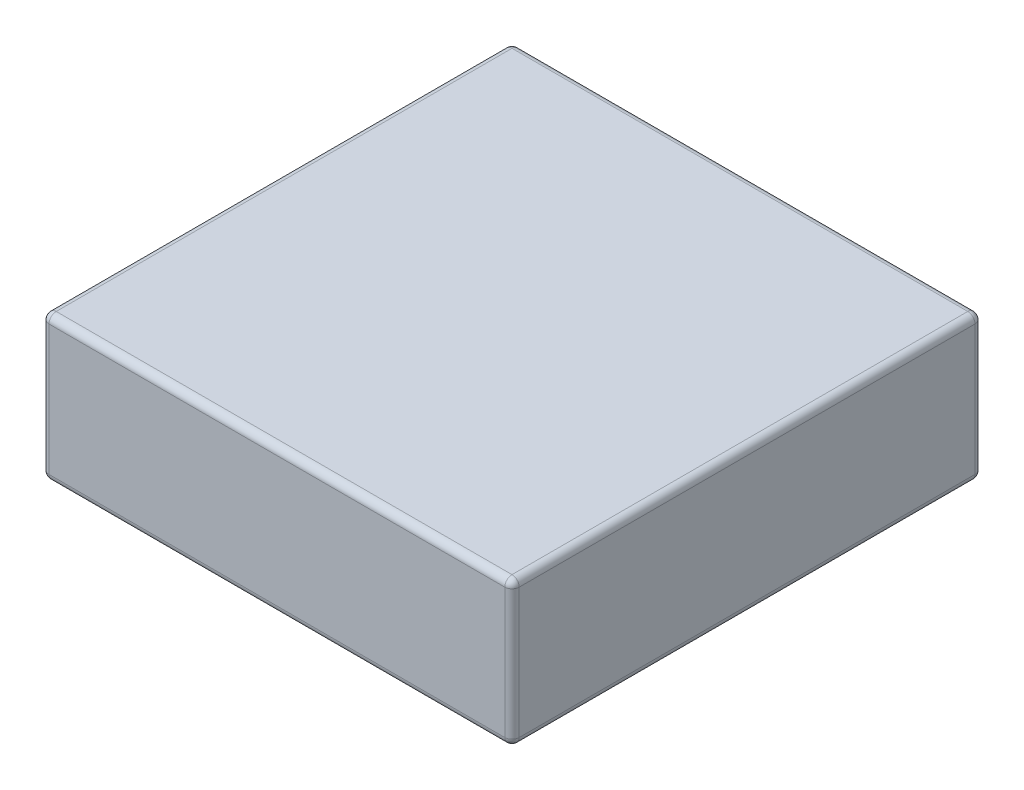
ISO-10303-21;
HEADER;
FILE_DESCRIPTION(('STEP AP214'),'2;1');
FILE_NAME('part.step','',(''),(''),'','','');
FILE_SCHEMA(('AUTOMOTIVE_DESIGN { 1 0 10303 214 1 1 1 1 }'));
ENDSEC;
DATA;
#1=APPLICATION_CONTEXT('core data for automotive mechanical design processes');
#2=APPLICATION_PROTOCOL_DEFINITION('international standard','automotive_design',2000,#1);
#3=PRODUCT_CONTEXT('',#1,'mechanical');
#4=PRODUCT('Part','Part','',(#3));
#5=PRODUCT_RELATED_PRODUCT_CATEGORY('part','',(#4));
#6=PRODUCT_DEFINITION_FORMATION('','',#4);
#7=PRODUCT_DEFINITION_CONTEXT('part definition',#1,'design');
#8=PRODUCT_DEFINITION('design','',#6,#7);
#9=PRODUCT_DEFINITION_SHAPE('','',#8);
#10=(LENGTH_UNIT() NAMED_UNIT(*) SI_UNIT(.MILLI.,.METRE.));
#11=(NAMED_UNIT(*) PLANE_ANGLE_UNIT() SI_UNIT($,.RADIAN.));
#12=(NAMED_UNIT(*) SI_UNIT($,.STERADIAN.) SOLID_ANGLE_UNIT());
#13=UNCERTAINTY_MEASURE_WITH_UNIT(LENGTH_MEASURE(1.E-05),#10,'distance_accuracy_value','');
#14=(GEOMETRIC_REPRESENTATION_CONTEXT(3) GLOBAL_UNCERTAINTY_ASSIGNED_CONTEXT((#13)) GLOBAL_UNIT_ASSIGNED_CONTEXT((#10,
#11,#12)) REPRESENTATION_CONTEXT('',''));
#15=CARTESIAN_POINT('',(0.,0.,0.));
#16=DIRECTION('',(0.,0.,1.));
#17=DIRECTION('',(1.,0.,0.));
#18=AXIS2_PLACEMENT_3D('',#15,#16,#17);
#19=CARTESIAN_POINT('',(0.,20.,0.));
#20=DIRECTION('',(1.,0.,0.));
#21=DIRECTION('',(0.,0.,-1.));
#22=AXIS2_PLACEMENT_3D('',#19,#20,#21);
#23=PLANE('',#22);
#24=DIRECTION('',(0.,-1.,0.));
#25=VECTOR('',#24,1.);
#26=CARTESIAN_POINT('',(0.,20.,-1.));
#27=LINE('',#26,#25);
#28=CARTESIAN_POINT('',(0.,1.,-1.));
#29=VERTEX_POINT('',#28);
#30=CARTESIAN_POINT('',(0.,19.,-1.));
#31=VERTEX_POINT('',#30);
#32=EDGE_CURVE('E138',#29,#31,#27,.F.);
#33=ORIENTED_EDGE('',*,*,#32,.T.);
#34=DIRECTION('',(0.,0.,1.));
#35=VECTOR('',#34,1.);
#36=CARTESIAN_POINT('',(0.,19.,0.));
#37=LINE('',#36,#35);
#38=CARTESIAN_POINT('',(0.,19.,-64.));
#39=VERTEX_POINT('',#38);
#40=EDGE_CURVE('E184',#31,#39,#37,.F.);
#41=ORIENTED_EDGE('',*,*,#40,.T.);
#42=DIRECTION('',(0.,-1.,0.));
#43=VECTOR('',#42,1.);
#44=CARTESIAN_POINT('',(0.,20.,-64.));
#45=LINE('',#44,#43);
#46=CARTESIAN_POINT('',(0.,1.,-64.));
#47=VERTEX_POINT('',#46);
#48=EDGE_CURVE('E179',#39,#47,#45,.T.);
#49=ORIENTED_EDGE('',*,*,#48,.T.);
#50=DIRECTION('',(0.,0.,1.));
#51=VECTOR('',#50,1.);
#52=CARTESIAN_POINT('',(0.,1.,0.));
#53=LINE('',#52,#51);
#54=EDGE_CURVE('E173',#47,#29,#53,.T.);
#55=ORIENTED_EDGE('',*,*,#54,.T.);
#56=EDGE_LOOP('',(#33,#41,#49,#55));
#57=FACE_BOUND('',#56,.T.);
#58=ADVANCED_FACE('F41',(#57),#23,.F.);
#59=CARTESIAN_POINT('',(0.,20.,0.));
#60=DIRECTION('',(0.,0.,-1.));
#61=DIRECTION('',(-1.,0.,0.));
#62=AXIS2_PLACEMENT_3D('',#59,#60,#61);
#63=PLANE('',#62);
#64=DIRECTION('',(0.,-1.,0.));
#65=VECTOR('',#64,1.);
#66=CARTESIAN_POINT('',(64.,20.,0.));
#67=LINE('',#66,#65);
#68=CARTESIAN_POINT('',(64.,1.,0.));
#69=VERTEX_POINT('',#68);
#70=CARTESIAN_POINT('',(64.,19.,0.));
#71=VERTEX_POINT('',#70);
#72=EDGE_CURVE('E163',#69,#71,#67,.F.);
#73=ORIENTED_EDGE('',*,*,#72,.T.);
#74=DIRECTION('',(1.,0.,0.));
#75=VECTOR('',#74,1.);
#76=CARTESIAN_POINT('',(0.,19.,0.));
#77=LINE('',#76,#75);
#78=CARTESIAN_POINT('',(1.,19.,0.));
#79=VERTEX_POINT('',#78);
#80=EDGE_CURVE('E167',#71,#79,#77,.F.);
#81=ORIENTED_EDGE('',*,*,#80,.T.);
#82=DIRECTION('',(0.,-1.,0.));
#83=VECTOR('',#82,1.);
#84=CARTESIAN_POINT('',(1.,20.,0.));
#85=LINE('',#84,#83);
#86=CARTESIAN_POINT('',(1.,1.,0.));
#87=VERTEX_POINT('',#86);
#88=EDGE_CURVE('E136',#79,#87,#85,.T.);
#89=ORIENTED_EDGE('',*,*,#88,.T.);
#90=DIRECTION('',(1.,0.,0.));
#91=VECTOR('',#90,1.);
#92=CARTESIAN_POINT('',(65.,1.,0.));
#93=LINE('',#92,#91);
#94=EDGE_CURVE('E156',#87,#69,#93,.T.);
#95=ORIENTED_EDGE('',*,*,#94,.T.);
#96=EDGE_LOOP('',(#73,#81,#89,#95));
#97=FACE_BOUND('',#96,.T.);
#98=ADVANCED_FACE('F165',(#97),#63,.F.);
#99=CARTESIAN_POINT('',(65.,20.,0.));
#100=DIRECTION('',(-1.,0.,0.));
#101=DIRECTION('',(0.,0.,1.));
#102=AXIS2_PLACEMENT_3D('',#99,#100,#101);
#103=PLANE('',#102);
#104=DIRECTION('',(0.,-1.,0.));
#105=VECTOR('',#104,1.);
#106=CARTESIAN_POINT('',(65.,20.,-64.));
#107=LINE('',#106,#105);
#108=CARTESIAN_POINT('',(65.,1.,-64.));
#109=VERTEX_POINT('',#108);
#110=CARTESIAN_POINT('',(65.,19.,-64.));
#111=VERTEX_POINT('',#110);
#112=EDGE_CURVE('E190',#109,#111,#107,.F.);
#113=ORIENTED_EDGE('',*,*,#112,.T.);
#114=DIRECTION('',(0.,0.,-1.));
#115=VECTOR('',#114,1.);
#116=CARTESIAN_POINT('',(65.,19.,0.));
#117=LINE('',#116,#115);
#118=CARTESIAN_POINT('',(65.,19.,-1.));
#119=VERTEX_POINT('',#118);
#120=EDGE_CURVE('E197',#111,#119,#117,.F.);
#121=ORIENTED_EDGE('',*,*,#120,.T.);
#122=DIRECTION('',(0.,-1.,0.));
#123=VECTOR('',#122,1.);
#124=CARTESIAN_POINT('',(65.,20.,-1.));
#125=LINE('',#124,#123);
#126=CARTESIAN_POINT('',(65.,1.,-1.));
#127=VERTEX_POINT('',#126);
#128=EDGE_CURVE('E193',#119,#127,#125,.T.);
#129=ORIENTED_EDGE('',*,*,#128,.T.);
#130=DIRECTION('',(0.,0.,-1.));
#131=VECTOR('',#130,1.);
#132=CARTESIAN_POINT('',(65.,1.,-65.));
#133=LINE('',#132,#131);
#134=EDGE_CURVE('E187',#127,#109,#133,.T.);
#135=ORIENTED_EDGE('',*,*,#134,.T.);
#136=EDGE_LOOP('',(#113,#121,#129,#135));
#137=FACE_BOUND('',#136,.T.);
#138=ADVANCED_FACE('F336',(#137),#103,.F.);
#139=CARTESIAN_POINT('',(0.,20.,-65.));
#140=DIRECTION('',(0.,0.,1.));
#141=DIRECTION('',(1.,0.,0.));
#142=AXIS2_PLACEMENT_3D('',#139,#140,#141);
#143=PLANE('',#142);
#144=DIRECTION('',(0.,-1.,0.));
#145=VECTOR('',#144,1.);
#146=CARTESIAN_POINT('',(1.,20.,-65.));
#147=LINE('',#146,#145);
#148=CARTESIAN_POINT('',(1.,1.,-65.));
#149=VERTEX_POINT('',#148);
#150=CARTESIAN_POINT('',(1.,19.,-65.));
#151=VERTEX_POINT('',#150);
#152=EDGE_CURVE('E203',#149,#151,#147,.F.);
#153=ORIENTED_EDGE('',*,*,#152,.T.);
#154=DIRECTION('',(-1.,0.,0.));
#155=VECTOR('',#154,1.);
#156=CARTESIAN_POINT('',(0.,19.,-65.));
#157=LINE('',#156,#155);
#158=CARTESIAN_POINT('',(64.,19.,-65.));
#159=VERTEX_POINT('',#158);
#160=EDGE_CURVE('E210',#151,#159,#157,.F.);
#161=ORIENTED_EDGE('',*,*,#160,.T.);
#162=DIRECTION('',(0.,-1.,0.));
#163=VECTOR('',#162,1.);
#164=CARTESIAN_POINT('',(64.,20.,-65.));
#165=LINE('',#164,#163);
#166=CARTESIAN_POINT('',(64.,1.,-65.));
#167=VERTEX_POINT('',#166);
#168=EDGE_CURVE('E206',#159,#167,#165,.T.);
#169=ORIENTED_EDGE('',*,*,#168,.T.);
#170=DIRECTION('',(-1.,0.,0.));
#171=VECTOR('',#170,1.);
#172=CARTESIAN_POINT('',(0.,1.,-65.));
#173=LINE('',#172,#171);
#174=EDGE_CURVE('E200',#167,#149,#173,.T.);
#175=ORIENTED_EDGE('',*,*,#174,.T.);
#176=EDGE_LOOP('',(#153,#161,#169,#175));
#177=FACE_BOUND('',#176,.T.);
#178=ADVANCED_FACE('F347',(#177),#143,.F.);
#179=CARTESIAN_POINT('',(0.,20.,0.));
#180=DIRECTION('',(0.,-1.,0.));
#181=DIRECTION('',(0.,0.,-1.));
#182=AXIS2_PLACEMENT_3D('',#179,#180,#181);
#183=PLANE('',#182);
#184=DIRECTION('',(0.,0.,-1.));
#185=VECTOR('',#184,1.);
#186=CARTESIAN_POINT('',(64.,20.,0.));
#187=LINE('',#186,#185);
#188=CARTESIAN_POINT('',(64.,20.,-1.));
#189=VERTEX_POINT('',#188);
#190=CARTESIAN_POINT('',(64.,20.,-64.));
#191=VERTEX_POINT('',#190);
#192=EDGE_CURVE('E219',#189,#191,#187,.T.);
#193=ORIENTED_EDGE('',*,*,#192,.T.);
#194=DIRECTION('',(-1.,0.,0.));
#195=VECTOR('',#194,1.);
#196=CARTESIAN_POINT('',(0.,20.,-64.));
#197=LINE('',#196,#195);
#198=CARTESIAN_POINT('',(1.,20.,-64.));
#199=VERTEX_POINT('',#198);
#200=EDGE_CURVE('E222',#191,#199,#197,.T.);
#201=ORIENTED_EDGE('',*,*,#200,.T.);
#202=DIRECTION('',(0.,0.,1.));
#203=VECTOR('',#202,1.);
#204=CARTESIAN_POINT('',(1.,20.,0.));
#205=LINE('',#204,#203);
#206=CARTESIAN_POINT('',(1.,20.,-1.));
#207=VERTEX_POINT('',#206);
#208=EDGE_CURVE('E213',#199,#207,#205,.T.);
#209=ORIENTED_EDGE('',*,*,#208,.T.);
#210=DIRECTION('',(1.,0.,0.));
#211=VECTOR('',#210,1.);
#212=CARTESIAN_POINT('',(0.,20.,-1.));
#213=LINE('',#212,#211);
#214=EDGE_CURVE('E216',#207,#189,#213,.T.);
#215=ORIENTED_EDGE('',*,*,#214,.T.);
#216=EDGE_LOOP('',(#193,#201,#209,#215));
#217=FACE_BOUND('',#216,.T.);
#218=ADVANCED_FACE('F328',(#217),#183,.F.);
#219=CARTESIAN_POINT('',(0.,0.,0.));
#220=DIRECTION('',(0.,-1.,0.));
#221=DIRECTION('',(0.,0.,-1.));
#222=AXIS2_PLACEMENT_3D('',#219,#220,#221);
#223=PLANE('',#222);
#224=DIRECTION('',(0.,0.,-1.));
#225=VECTOR('',#224,1.);
#226=CARTESIAN_POINT('',(64.,0.,0.));
#227=LINE('',#226,#225);
#228=CARTESIAN_POINT('',(64.,0.,-64.));
#229=VERTEX_POINT('',#228);
#230=CARTESIAN_POINT('',(64.,0.,-1.));
#231=VERTEX_POINT('',#230);
#232=EDGE_CURVE('E51',#229,#231,#227,.F.);
#233=ORIENTED_EDGE('',*,*,#232,.T.);
#234=DIRECTION('',(1.,0.,0.));
#235=VECTOR('',#234,1.);
#236=CARTESIAN_POINT('',(0.,0.,-1.));
#237=LINE('',#236,#235);
#238=CARTESIAN_POINT('',(1.,0.,-1.));
#239=VERTEX_POINT('',#238);
#240=EDGE_CURVE('E12',#231,#239,#237,.F.);
#241=ORIENTED_EDGE('',*,*,#240,.T.);
#242=DIRECTION('',(0.,0.,1.));
#243=VECTOR('',#242,1.);
#244=CARTESIAN_POINT('',(1.,0.,-65.));
#245=LINE('',#244,#243);
#246=CARTESIAN_POINT('',(1.,0.,-64.));
#247=VERTEX_POINT('',#246);
#248=EDGE_CURVE('E226',#239,#247,#245,.F.);
#249=ORIENTED_EDGE('',*,*,#248,.T.);
#250=DIRECTION('',(-1.,0.,0.));
#251=VECTOR('',#250,1.);
#252=CARTESIAN_POINT('',(65.,0.,-64.));
#253=LINE('',#252,#251);
#254=EDGE_CURVE('E62',#247,#229,#253,.F.);
#255=ORIENTED_EDGE('',*,*,#254,.T.);
#256=EDGE_LOOP('',(#233,#241,#249,#255));
#257=FACE_BOUND('',#256,.T.);
#258=ADVANCED_FACE('F449',(#257),#223,.T.);
#259=CARTESIAN_POINT('',(64.,20.,-64.));
#260=DIRECTION('',(0.,-1.,0.));
#261=DIRECTION('',(0.,0.,-1.));
#262=AXIS2_PLACEMENT_3D('',#259,#260,#261);
#263=CYLINDRICAL_SURFACE('',#262,1.);
#264=CARTESIAN_POINT('',(64.,19.,-64.));
#265=DIRECTION('',(0.,1.,0.));
#266=DIRECTION('',(0.,0.,1.));
#267=AXIS2_PLACEMENT_3D('',#264,#265,#266);
#268=CIRCLE('',#267,1.);
#269=EDGE_CURVE('E45',#111,#159,#268,.T.);
#270=ORIENTED_EDGE('',*,*,#269,.F.);
#271=ORIENTED_EDGE('',*,*,#112,.F.);
#272=CARTESIAN_POINT('',(64.,1.,-64.));
#273=DIRECTION('',(0.,-1.,0.));
#274=DIRECTION('',(0.,0.,-1.));
#275=AXIS2_PLACEMENT_3D('',#272,#273,#274);
#276=CIRCLE('',#275,1.);
#277=EDGE_CURVE('E303',#167,#109,#276,.T.);
#278=ORIENTED_EDGE('',*,*,#277,.F.);
#279=ORIENTED_EDGE('',*,*,#168,.F.);
#280=EDGE_LOOP('',(#270,#271,#278,#279));
#281=FACE_BOUND('',#280,.T.);
#282=ADVANCED_FACE('F43',(#281),#263,.T.);
#283=CARTESIAN_POINT('',(64.,19.,-64.));
#284=DIRECTION('',(0.,0.,-1.));
#285=DIRECTION('',(-1.,0.,0.));
#286=AXIS2_PLACEMENT_3D('',#283,#284,#285);
#287=SPHERICAL_SURFACE('',#286,1.);
#288=CARTESIAN_POINT('',(64.,19.,-64.));
#289=DIRECTION('',(0.,0.,-1.));
#290=DIRECTION('',(-1.,0.,0.));
#291=AXIS2_PLACEMENT_3D('',#288,#289,#290);
#292=CIRCLE('',#291,1.);
#293=EDGE_CURVE('E296',#111,#191,#292,.F.);
#294=ORIENTED_EDGE('',*,*,#293,.F.);
#295=ORIENTED_EDGE('',*,*,#269,.T.);
#296=CARTESIAN_POINT('',(64.,19.,-64.));
#297=DIRECTION('',(1.,0.,0.));
#298=DIRECTION('',(0.,0.,-1.));
#299=AXIS2_PLACEMENT_3D('',#296,#297,#298);
#300=CIRCLE('',#299,1.);
#301=EDGE_CURVE('E300',#191,#159,#300,.F.);
#302=ORIENTED_EDGE('',*,*,#301,.F.);
#303=EDGE_LOOP('',(#294,#295,#302));
#304=FACE_BOUND('',#303,.T.);
#305=ADVANCED_FACE('F316',(#304),#287,.T.);
#306=CARTESIAN_POINT('',(64.,1.,-64.));
#307=DIRECTION('',(1.,0.,0.));
#308=DIRECTION('',(0.,1.,0.));
#309=AXIS2_PLACEMENT_3D('',#306,#307,#308);
#310=SPHERICAL_SURFACE('',#309,1.);
#311=CARTESIAN_POINT('',(64.,1.,-64.));
#312=DIRECTION('',(1.,0.,0.));
#313=DIRECTION('',(0.,0.,-1.));
#314=AXIS2_PLACEMENT_3D('',#311,#312,#313);
#315=CIRCLE('',#314,1.);
#316=EDGE_CURVE('E289',#167,#229,#315,.F.);
#317=ORIENTED_EDGE('',*,*,#316,.F.);
#318=ORIENTED_EDGE('',*,*,#277,.T.);
#319=CARTESIAN_POINT('',(64.,1.,-64.));
#320=DIRECTION('',(0.,0.,-1.));
#321=DIRECTION('',(-1.,0.,0.));
#322=AXIS2_PLACEMENT_3D('',#319,#320,#321);
#323=CIRCLE('',#322,1.);
#324=EDGE_CURVE('E292',#229,#109,#323,.F.);
#325=ORIENTED_EDGE('',*,*,#324,.F.);
#326=EDGE_LOOP('',(#317,#318,#325));
#327=FACE_BOUND('',#326,.T.);
#328=ADVANCED_FACE('F474',(#327),#310,.T.);
#329=CARTESIAN_POINT('',(0.,19.,-64.));
#330=DIRECTION('',(-1.,0.,0.));
#331=DIRECTION('',(0.,0.,1.));
#332=AXIS2_PLACEMENT_3D('',#329,#330,#331);
#333=CYLINDRICAL_SURFACE('',#332,1.);
#334=ORIENTED_EDGE('',*,*,#301,.T.);
#335=ORIENTED_EDGE('',*,*,#160,.F.);
#336=CARTESIAN_POINT('',(1.,19.,-64.));
#337=DIRECTION('',(-1.,0.,0.));
#338=DIRECTION('',(0.,0.,1.));
#339=AXIS2_PLACEMENT_3D('',#336,#337,#338);
#340=CIRCLE('',#339,1.);
#341=EDGE_CURVE('E281',#199,#151,#340,.T.);
#342=ORIENTED_EDGE('',*,*,#341,.F.);
#343=ORIENTED_EDGE('',*,*,#200,.F.);
#344=EDGE_LOOP('',(#334,#335,#342,#343));
#345=FACE_BOUND('',#344,.T.);
#346=ADVANCED_FACE('F324',(#345),#333,.T.);
#347=CARTESIAN_POINT('',(64.,19.,0.));
#348=DIRECTION('',(0.,0.,-1.));
#349=DIRECTION('',(-1.,0.,0.));
#350=AXIS2_PLACEMENT_3D('',#347,#348,#349);
#351=CYLINDRICAL_SURFACE('',#350,1.);
#352=ORIENTED_EDGE('',*,*,#293,.T.);
#353=ORIENTED_EDGE('',*,*,#192,.F.);
#354=CARTESIAN_POINT('',(64.,19.,-1.));
#355=DIRECTION('',(0.,0.,1.));
#356=DIRECTION('',(1.,0.,0.));
#357=AXIS2_PLACEMENT_3D('',#354,#355,#356);
#358=CIRCLE('',#357,1.);
#359=EDGE_CURVE('E277',#119,#189,#358,.T.);
#360=ORIENTED_EDGE('',*,*,#359,.F.);
#361=ORIENTED_EDGE('',*,*,#120,.F.);
#362=EDGE_LOOP('',(#352,#353,#360,#361));
#363=FACE_BOUND('',#362,.T.);
#364=ADVANCED_FACE('F333',(#363),#351,.T.);
#365=CARTESIAN_POINT('',(64.,20.,-1.));
#366=DIRECTION('',(0.,-1.,0.));
#367=DIRECTION('',(0.,0.,-1.));
#368=AXIS2_PLACEMENT_3D('',#365,#366,#367);
#369=CYLINDRICAL_SURFACE('',#368,1.);
#370=CARTESIAN_POINT('',(64.,1.,-1.));
#371=DIRECTION('',(0.,-1.,0.));
#372=DIRECTION('',(0.,0.,-1.));
#373=AXIS2_PLACEMENT_3D('',#370,#371,#372);
#374=CIRCLE('',#373,1.);
#375=EDGE_CURVE('E269',#127,#69,#374,.T.);
#376=ORIENTED_EDGE('',*,*,#375,.F.);
#377=ORIENTED_EDGE('',*,*,#128,.F.);
#378=CARTESIAN_POINT('',(64.,19.,-1.));
#379=DIRECTION('',(0.,1.,0.));
#380=DIRECTION('',(0.,0.,1.));
#381=AXIS2_PLACEMENT_3D('',#378,#379,#380);
#382=CIRCLE('',#381,1.);
#383=EDGE_CURVE('E273',#71,#119,#382,.T.);
#384=ORIENTED_EDGE('',*,*,#383,.F.);
#385=ORIENTED_EDGE('',*,*,#72,.F.);
#386=EDGE_LOOP('',(#376,#377,#384,#385));
#387=FACE_BOUND('',#386,.T.);
#388=ADVANCED_FACE('F340',(#387),#369,.T.);
#389=CARTESIAN_POINT('',(64.,1.,0.));
#390=DIRECTION('',(0.,0.,1.));
#391=DIRECTION('',(1.,0.,0.));
#392=AXIS2_PLACEMENT_3D('',#389,#390,#391);
#393=CYLINDRICAL_SURFACE('',#392,1.);
#394=ORIENTED_EDGE('',*,*,#324,.T.);
#395=ORIENTED_EDGE('',*,*,#134,.F.);
#396=CARTESIAN_POINT('',(64.,1.,-1.));
#397=DIRECTION('',(0.,0.,1.));
#398=DIRECTION('',(1.,0.,0.));
#399=AXIS2_PLACEMENT_3D('',#396,#397,#398);
#400=CIRCLE('',#399,1.);
#401=EDGE_CURVE('E266',#231,#127,#400,.T.);
#402=ORIENTED_EDGE('',*,*,#401,.F.);
#403=ORIENTED_EDGE('',*,*,#232,.F.);
#404=EDGE_LOOP('',(#394,#395,#402,#403));
#405=FACE_BOUND('',#404,.T.);
#406=ADVANCED_FACE('F345',(#405),#393,.T.);
#407=CARTESIAN_POINT('',(0.,1.,-64.));
#408=DIRECTION('',(1.,0.,0.));
#409=DIRECTION('',(0.,0.,-1.));
#410=AXIS2_PLACEMENT_3D('',#407,#408,#409);
#411=CYLINDRICAL_SURFACE('',#410,1.);
#412=ORIENTED_EDGE('',*,*,#316,.T.);
#413=ORIENTED_EDGE('',*,*,#254,.F.);
#414=CARTESIAN_POINT('',(1.,1.,-64.));
#415=DIRECTION('',(-1.,0.,0.));
#416=DIRECTION('',(0.,0.,1.));
#417=AXIS2_PLACEMENT_3D('',#414,#415,#416);
#418=CIRCLE('',#417,1.);
#419=EDGE_CURVE('E262',#149,#247,#418,.T.);
#420=ORIENTED_EDGE('',*,*,#419,.F.);
#421=ORIENTED_EDGE('',*,*,#174,.F.);
#422=EDGE_LOOP('',(#412,#413,#420,#421));
#423=FACE_BOUND('',#422,.T.);
#424=ADVANCED_FACE('F356',(#423),#411,.T.);
#425=CARTESIAN_POINT('',(1.,20.,-64.));
#426=DIRECTION('',(0.,-1.,0.));
#427=DIRECTION('',(0.,0.,-1.));
#428=AXIS2_PLACEMENT_3D('',#425,#426,#427);
#429=CYLINDRICAL_SURFACE('',#428,1.);
#430=CARTESIAN_POINT('',(1.,19.,-64.));
#431=DIRECTION('',(0.,1.,0.));
#432=DIRECTION('',(0.,0.,1.));
#433=AXIS2_PLACEMENT_3D('',#430,#431,#432);
#434=CIRCLE('',#433,1.);
#435=EDGE_CURVE('E285',#151,#39,#434,.T.);
#436=ORIENTED_EDGE('',*,*,#435,.F.);
#437=ORIENTED_EDGE('',*,*,#152,.F.);
#438=CARTESIAN_POINT('',(1.,1.,-64.));
#439=DIRECTION('',(0.,-1.,0.));
#440=DIRECTION('',(0.,0.,-1.));
#441=AXIS2_PLACEMENT_3D('',#438,#439,#440);
#442=CIRCLE('',#441,1.);
#443=EDGE_CURVE('E258',#47,#149,#442,.T.);
#444=ORIENTED_EDGE('',*,*,#443,.F.);
#445=ORIENTED_EDGE('',*,*,#48,.F.);
#446=EDGE_LOOP('',(#436,#437,#444,#445));
#447=FACE_BOUND('',#446,.T.);
#448=ADVANCED_FACE('F352',(#447),#429,.T.);
#449=CARTESIAN_POINT('',(1.,19.,-64.));
#450=DIRECTION('',(0.,0.,-1.));
#451=DIRECTION('',(-1.,0.,0.));
#452=AXIS2_PLACEMENT_3D('',#449,#450,#451);
#453=SPHERICAL_SURFACE('',#452,1.);
#454=ORIENTED_EDGE('',*,*,#341,.T.);
#455=ORIENTED_EDGE('',*,*,#435,.T.);
#456=CARTESIAN_POINT('',(1.,19.,-64.));
#457=DIRECTION('',(0.,0.,-1.));
#458=DIRECTION('',(-1.,0.,0.));
#459=AXIS2_PLACEMENT_3D('',#456,#457,#458);
#460=CIRCLE('',#459,1.);
#461=EDGE_CURVE('E254',#199,#39,#460,.F.);
#462=ORIENTED_EDGE('',*,*,#461,.F.);
#463=EDGE_LOOP('',(#454,#455,#462));
#464=FACE_BOUND('',#463,.T.);
#465=ADVANCED_FACE('F366',(#464),#453,.T.);
#466=CARTESIAN_POINT('',(64.,19.,-1.));
#467=DIRECTION('',(1.,0.,0.));
#468=DIRECTION('',(0.,0.,-1.));
#469=AXIS2_PLACEMENT_3D('',#466,#467,#468);
#470=SPHERICAL_SURFACE('',#469,1.);
#471=ORIENTED_EDGE('',*,*,#383,.T.);
#472=ORIENTED_EDGE('',*,*,#359,.T.);
#473=CARTESIAN_POINT('',(64.,19.,-1.));
#474=DIRECTION('',(1.,0.,0.));
#475=DIRECTION('',(0.,0.,-1.));
#476=AXIS2_PLACEMENT_3D('',#473,#474,#475);
#477=CIRCLE('',#476,1.);
#478=EDGE_CURVE('E250',#71,#189,#477,.F.);
#479=ORIENTED_EDGE('',*,*,#478,.F.);
#480=EDGE_LOOP('',(#471,#472,#479));
#481=FACE_BOUND('',#480,.T.);
#482=ADVANCED_FACE('F376',(#481),#470,.T.);
#483=CARTESIAN_POINT('',(64.,1.,-1.));
#484=DIRECTION('',(1.,0.,0.));
#485=DIRECTION('',(0.,1.,0.));
#486=AXIS2_PLACEMENT_3D('',#483,#484,#485);
#487=SPHERICAL_SURFACE('',#486,1.);
#488=ORIENTED_EDGE('',*,*,#401,.T.);
#489=ORIENTED_EDGE('',*,*,#375,.T.);
#490=CARTESIAN_POINT('',(64.,1.,-1.));
#491=DIRECTION('',(1.,0.,0.));
#492=DIRECTION('',(0.,0.,-1.));
#493=AXIS2_PLACEMENT_3D('',#490,#491,#492);
#494=CIRCLE('',#493,1.);
#495=EDGE_CURVE('E159',#231,#69,#494,.F.);
#496=ORIENTED_EDGE('',*,*,#495,.F.);
#497=EDGE_LOOP('',(#488,#489,#496));
#498=FACE_BOUND('',#497,.T.);
#499=ADVANCED_FACE('F378',(#498),#487,.T.);
#500=CARTESIAN_POINT('',(1.,1.,-64.));
#501=DIRECTION('',(0.,0.,-1.));
#502=DIRECTION('',(0.,1.,0.));
#503=AXIS2_PLACEMENT_3D('',#500,#501,#502);
#504=SPHERICAL_SURFACE('',#503,1.);
#505=ORIENTED_EDGE('',*,*,#443,.T.);
#506=ORIENTED_EDGE('',*,*,#419,.T.);
#507=CARTESIAN_POINT('',(1.,1.,-64.));
#508=DIRECTION('',(0.,0.,-1.));
#509=DIRECTION('',(-1.,0.,0.));
#510=AXIS2_PLACEMENT_3D('',#507,#508,#509);
#511=CIRCLE('',#510,1.);
#512=EDGE_CURVE('E244',#47,#247,#511,.F.);
#513=ORIENTED_EDGE('',*,*,#512,.F.);
#514=EDGE_LOOP('',(#505,#506,#513));
#515=FACE_BOUND('',#514,.T.);
#516=ADVANCED_FACE('F358',(#515),#504,.T.);
#517=CARTESIAN_POINT('',(1.,19.,0.));
#518=DIRECTION('',(0.,0.,1.));
#519=DIRECTION('',(1.,0.,0.));
#520=AXIS2_PLACEMENT_3D('',#517,#518,#519);
#521=CYLINDRICAL_SURFACE('',#520,1.);
#522=ORIENTED_EDGE('',*,*,#461,.T.);
#523=ORIENTED_EDGE('',*,*,#40,.F.);
#524=CARTESIAN_POINT('',(1.,19.,-1.));
#525=DIRECTION('',(0.,0.,1.));
#526=DIRECTION('',(1.,0.,0.));
#527=AXIS2_PLACEMENT_3D('',#524,#525,#526);
#528=CIRCLE('',#527,1.);
#529=EDGE_CURVE('E240',#207,#31,#528,.T.);
#530=ORIENTED_EDGE('',*,*,#529,.F.);
#531=ORIENTED_EDGE('',*,*,#208,.F.);
#532=EDGE_LOOP('',(#522,#523,#530,#531));
#533=FACE_BOUND('',#532,.T.);
#534=ADVANCED_FACE('F368',(#533),#521,.T.);
#535=CARTESIAN_POINT('',(0.,19.,-1.));
#536=DIRECTION('',(1.,0.,0.));
#537=DIRECTION('',(0.,0.,-1.));
#538=AXIS2_PLACEMENT_3D('',#535,#536,#537);
#539=CYLINDRICAL_SURFACE('',#538,1.);
#540=ORIENTED_EDGE('',*,*,#478,.T.);
#541=ORIENTED_EDGE('',*,*,#214,.F.);
#542=CARTESIAN_POINT('',(1.,19.,-1.));
#543=DIRECTION('',(-1.,0.,0.));
#544=DIRECTION('',(0.,0.,1.));
#545=AXIS2_PLACEMENT_3D('',#542,#543,#544);
#546=CIRCLE('',#545,1.);
#547=EDGE_CURVE('E153',#79,#207,#546,.T.);
#548=ORIENTED_EDGE('',*,*,#547,.F.);
#549=ORIENTED_EDGE('',*,*,#80,.F.);
#550=EDGE_LOOP('',(#540,#541,#548,#549));
#551=FACE_BOUND('',#550,.T.);
#552=ADVANCED_FACE('F374',(#551),#539,.T.);
#553=CARTESIAN_POINT('',(0.,1.,-1.));
#554=DIRECTION('',(-1.,0.,0.));
#555=DIRECTION('',(0.,0.,1.));
#556=AXIS2_PLACEMENT_3D('',#553,#554,#555);
#557=CYLINDRICAL_SURFACE('',#556,1.);
#558=ORIENTED_EDGE('',*,*,#495,.T.);
#559=ORIENTED_EDGE('',*,*,#94,.F.);
#560=CARTESIAN_POINT('',(1.,1.,-1.));
#561=DIRECTION('',(-1.,0.,0.));
#562=DIRECTION('',(0.,0.,1.));
#563=AXIS2_PLACEMENT_3D('',#560,#561,#562);
#564=CIRCLE('',#563,1.);
#565=EDGE_CURVE('E144',#239,#87,#564,.T.);
#566=ORIENTED_EDGE('',*,*,#565,.F.);
#567=ORIENTED_EDGE('',*,*,#240,.F.);
#568=EDGE_LOOP('',(#558,#559,#566,#567));
#569=FACE_BOUND('',#568,.T.);
#570=ADVANCED_FACE('F157',(#569),#557,.T.);
#571=CARTESIAN_POINT('',(1.,1.,0.));
#572=DIRECTION('',(0.,0.,-1.));
#573=DIRECTION('',(-1.,0.,0.));
#574=AXIS2_PLACEMENT_3D('',#571,#572,#573);
#575=CYLINDRICAL_SURFACE('',#574,1.);
#576=ORIENTED_EDGE('',*,*,#512,.T.);
#577=ORIENTED_EDGE('',*,*,#248,.F.);
#578=CARTESIAN_POINT('',(1.,1.,-1.));
#579=DIRECTION('',(0.,0.,1.));
#580=DIRECTION('',(1.,0.,0.));
#581=AXIS2_PLACEMENT_3D('',#578,#579,#580);
#582=CIRCLE('',#581,1.);
#583=EDGE_CURVE('E148',#29,#239,#582,.T.);
#584=ORIENTED_EDGE('',*,*,#583,.F.);
#585=ORIENTED_EDGE('',*,*,#54,.F.);
#586=EDGE_LOOP('',(#576,#577,#584,#585));
#587=FACE_BOUND('',#586,.T.);
#588=ADVANCED_FACE('F361',(#587),#575,.T.);
#589=CARTESIAN_POINT('',(1.,19.,-1.));
#590=DIRECTION('',(0.,1.,0.));
#591=DIRECTION('',(0.,0.,1.));
#592=AXIS2_PLACEMENT_3D('',#589,#590,#591);
#593=SPHERICAL_SURFACE('',#592,1.);
#594=ORIENTED_EDGE('',*,*,#547,.T.);
#595=ORIENTED_EDGE('',*,*,#529,.T.);
#596=CARTESIAN_POINT('',(1.,19.,-1.));
#597=DIRECTION('',(0.,1.,0.));
#598=DIRECTION('',(0.,0.,1.));
#599=AXIS2_PLACEMENT_3D('',#596,#597,#598);
#600=CIRCLE('',#599,1.);
#601=EDGE_CURVE('E141',#79,#31,#600,.F.);
#602=ORIENTED_EDGE('',*,*,#601,.F.);
#603=EDGE_LOOP('',(#594,#595,#602));
#604=FACE_BOUND('',#603,.T.);
#605=ADVANCED_FACE('F372',(#604),#593,.T.);
#606=CARTESIAN_POINT('',(1.,1.,-1.));
#607=DIRECTION('',(0.,-1.,0.));
#608=DIRECTION('',(0.,0.,-1.));
#609=AXIS2_PLACEMENT_3D('',#606,#607,#608);
#610=SPHERICAL_SURFACE('',#609,1.);
#611=ORIENTED_EDGE('',*,*,#583,.T.);
#612=ORIENTED_EDGE('',*,*,#565,.T.);
#613=CARTESIAN_POINT('',(1.,1.,-1.));
#614=DIRECTION('',(0.,-1.,0.));
#615=DIRECTION('',(0.,0.,-1.));
#616=AXIS2_PLACEMENT_3D('',#613,#614,#615);
#617=CIRCLE('',#616,1.);
#618=EDGE_CURVE('E132',#29,#87,#617,.F.);
#619=ORIENTED_EDGE('',*,*,#618,.F.);
#620=EDGE_LOOP('',(#611,#612,#619));
#621=FACE_BOUND('',#620,.T.);
#622=ADVANCED_FACE('F146',(#621),#610,.T.);
#623=CARTESIAN_POINT('',(1.,20.,-1.));
#624=DIRECTION('',(0.,-1.,0.));
#625=DIRECTION('',(0.,0.,-1.));
#626=AXIS2_PLACEMENT_3D('',#623,#624,#625);
#627=CYLINDRICAL_SURFACE('',#626,1.);
#628=ORIENTED_EDGE('',*,*,#601,.T.);
#629=ORIENTED_EDGE('',*,*,#32,.F.);
#630=ORIENTED_EDGE('',*,*,#618,.T.);
#631=ORIENTED_EDGE('',*,*,#88,.F.);
#632=EDGE_LOOP('',(#628,#629,#630,#631));
#633=FACE_BOUND('',#632,.T.);
#634=ADVANCED_FACE('F134',(#633),#627,.T.);
#635=CLOSED_SHELL('',(#58,#98,#138,#178,#218,#258,#282,#305,#328,#346,#364,#388,#406,#424,#448,
#465,#482,#499,#516,#534,#552,#570,#588,#605,#622,#634));
#636=MANIFOLD_SOLID_BREP('B2',#635);
#637=ADVANCED_BREP_SHAPE_REPRESENTATION('',(#18,#636),#14);
#638=SHAPE_DEFINITION_REPRESENTATION(#9,#637);
ENDSEC;
END-ISO-10303-21;
